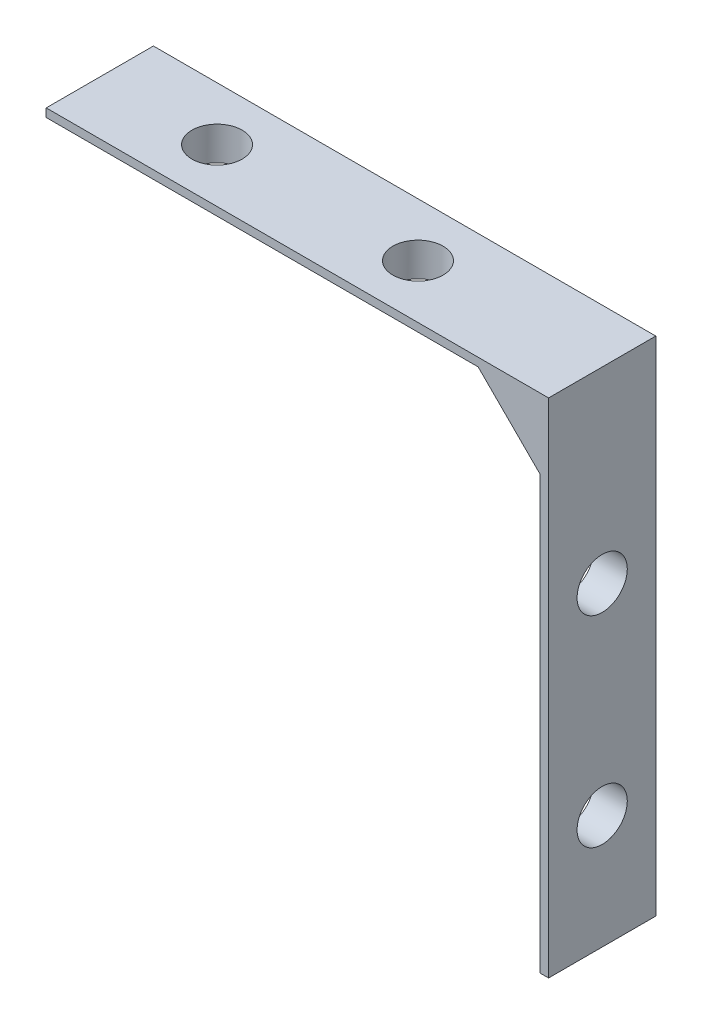
ISO-10303-21;
HEADER;
FILE_DESCRIPTION(('STEP AP214'),'2;1');
FILE_NAME('part.step','',(''),(''),'','','');
FILE_SCHEMA(('AUTOMOTIVE_DESIGN { 1 0 10303 214 1 1 1 1 }'));
ENDSEC;
DATA;
#1=APPLICATION_CONTEXT('core data for automotive mechanical design processes');
#2=APPLICATION_PROTOCOL_DEFINITION('international standard','automotive_design',2000,#1);
#3=PRODUCT_CONTEXT('',#1,'mechanical');
#4=PRODUCT('Part','Part','',(#3));
#5=PRODUCT_RELATED_PRODUCT_CATEGORY('part','',(#4));
#6=PRODUCT_DEFINITION_FORMATION('','',#4);
#7=PRODUCT_DEFINITION_CONTEXT('part definition',#1,'design');
#8=PRODUCT_DEFINITION('design','',#6,#7);
#9=PRODUCT_DEFINITION_SHAPE('','',#8);
#10=(LENGTH_UNIT() NAMED_UNIT(*) SI_UNIT(.MILLI.,.METRE.));
#11=(NAMED_UNIT(*) PLANE_ANGLE_UNIT() SI_UNIT($,.RADIAN.));
#12=(NAMED_UNIT(*) SI_UNIT($,.STERADIAN.) SOLID_ANGLE_UNIT());
#13=UNCERTAINTY_MEASURE_WITH_UNIT(LENGTH_MEASURE(1.E-05),#10,'distance_accuracy_value','');
#14=(GEOMETRIC_REPRESENTATION_CONTEXT(3) GLOBAL_UNCERTAINTY_ASSIGNED_CONTEXT((#13)) GLOBAL_UNIT_ASSIGNED_CONTEXT((#10,
#11,#12)) REPRESENTATION_CONTEXT('',''));
#15=CARTESIAN_POINT('',(0.,0.,0.));
#16=DIRECTION('',(0.,0.,1.));
#17=DIRECTION('',(1.,0.,0.));
#18=AXIS2_PLACEMENT_3D('',#15,#16,#17);
#19=CARTESIAN_POINT('',(-2.,-4.82842712474618,6.4));
#20=DIRECTION('',(1.,0.,0.));
#21=DIRECTION('',(0.,1.,0.));
#22=AXIS2_PLACEMENT_3D('',#19,#20,#21);
#23=PLANE('',#22);
#24=CARTESIAN_POINT('',(-2.,-11.1936831627406,3.2));
#25=DIRECTION('',(1.,0.,0.));
#26=DIRECTION('',(0.,1.,0.));
#27=AXIS2_PLACEMENT_3D('',#24,#25,#26);
#28=CIRCLE('',#27,1.5);
#29=CARTESIAN_POINT('',(-2.,-9.69368316274065,3.2));
#30=VERTEX_POINT('',#29);
#31=EDGE_CURVE('E331',#30,#30,#28,.F.);
#32=ORIENTED_EDGE('',*,*,#31,.F.);
#33=EDGE_LOOP('',(#32));
#34=FACE_BOUND('',#33,.T.);
#35=CARTESIAN_POINT('',(-2.,-23.1936831627406,3.2));
#36=DIRECTION('',(1.,0.,0.));
#37=DIRECTION('',(0.,1.,0.));
#38=AXIS2_PLACEMENT_3D('',#35,#36,#37);
#39=CIRCLE('',#38,1.5);
#40=CARTESIAN_POINT('',(-2.,-21.6936831627406,3.2));
#41=VERTEX_POINT('',#40);
#42=EDGE_CURVE('E326',#41,#41,#39,.F.);
#43=ORIENTED_EDGE('',*,*,#42,.F.);
#44=EDGE_LOOP('',(#43));
#45=FACE_BOUND('',#44,.T.);
#46=DIRECTION('',(0.,0.,-1.));
#47=VECTOR('',#46,1.);
#48=CARTESIAN_POINT('',(-2.,-30.,6.4));
#49=LINE('',#48,#47);
#50=CARTESIAN_POINT('',(-2.,-30.,4.9));
#51=VERTEX_POINT('',#50);
#52=CARTESIAN_POINT('',(-2.,-30.,1.5));
#53=VERTEX_POINT('',#52);
#54=EDGE_CURVE('E141',#51,#53,#49,.T.);
#55=ORIENTED_EDGE('',*,*,#54,.F.);
#56=DIRECTION('',(0.,1.,0.));
#57=VECTOR('',#56,1.);
#58=CARTESIAN_POINT('',(-2.,-4.82842712474618,4.9));
#59=LINE('',#58,#57);
#60=CARTESIAN_POINT('',(-2.,-4.82842712474618,4.9));
#61=VERTEX_POINT('',#60);
#62=EDGE_CURVE('E209',#51,#61,#59,.T.);
#63=ORIENTED_EDGE('',*,*,#62,.T.);
#64=DIRECTION('',(0.,0.,-1.));
#65=VECTOR('',#64,1.);
#66=CARTESIAN_POINT('',(-2.,-4.82842712474618,6.4));
#67=LINE('',#66,#65);
#68=CARTESIAN_POINT('',(-2.,-4.82842712474618,1.5));
#69=VERTEX_POINT('',#68);
#70=EDGE_CURVE('E155',#61,#69,#67,.T.);
#71=ORIENTED_EDGE('',*,*,#70,.T.);
#72=DIRECTION('',(0.,-1.,0.));
#73=VECTOR('',#72,1.);
#74=CARTESIAN_POINT('',(-2.,-30.,1.5));
#75=LINE('',#74,#73);
#76=EDGE_CURVE('E182',#69,#53,#75,.T.);
#77=ORIENTED_EDGE('',*,*,#76,.T.);
#78=EDGE_LOOP('',(#55,#63,#71,#77));
#79=FACE_BOUND('',#78,.T.);
#80=ADVANCED_FACE('F38',(#34,#45,#79),#23,.F.);
#81=CARTESIAN_POINT('',(0.,-30.,6.4));
#82=DIRECTION('',(0.,1.,0.));
#83=DIRECTION('',(-1.,0.,0.));
#84=AXIS2_PLACEMENT_3D('',#81,#82,#83);
#85=PLANE('',#84);
#86=DIRECTION('',(1.,0.,0.));
#87=VECTOR('',#86,1.);
#88=CARTESIAN_POINT('',(0.,-30.,6.4));
#89=LINE('',#88,#87);
#90=CARTESIAN_POINT('',(-0.499999999999996,-30.,6.4));
#91=VERTEX_POINT('',#90);
#92=CARTESIAN_POINT('',(0.,-30.,6.4));
#93=VERTEX_POINT('',#92);
#94=EDGE_CURVE('E123',#91,#93,#89,.T.);
#95=ORIENTED_EDGE('',*,*,#94,.F.);
#96=DIRECTION('',(0.707106781186547,0.,0.707106781186549));
#97=VECTOR('',#96,1.);
#98=CARTESIAN_POINT('',(-0.499999999999972,-30.,6.40000000000002));
#99=LINE('',#98,#97);
#100=EDGE_CURVE('E207',#91,#51,#99,.F.);
#101=ORIENTED_EDGE('',*,*,#100,.T.);
#102=ORIENTED_EDGE('',*,*,#54,.T.);
#103=DIRECTION('',(0.707106781186549,0.,-0.707106781186546));
#104=VECTOR('',#103,1.);
#105=CARTESIAN_POINT('',(-1.99999999999998,-30.,1.49999999999998));
#106=LINE('',#105,#104);
#107=CARTESIAN_POINT('',(-0.49999999999999,-30.,0.));
#108=VERTEX_POINT('',#107);
#109=EDGE_CURVE('E185',#53,#108,#106,.T.);
#110=ORIENTED_EDGE('',*,*,#109,.T.);
#111=DIRECTION('',(1.,0.,0.));
#112=VECTOR('',#111,1.);
#113=CARTESIAN_POINT('',(0.,-30.,0.));
#114=LINE('',#113,#112);
#115=CARTESIAN_POINT('',(0.,-30.,0.));
#116=VERTEX_POINT('',#115);
#117=EDGE_CURVE('E138',#108,#116,#114,.T.);
#118=ORIENTED_EDGE('',*,*,#117,.T.);
#119=DIRECTION('',(0.,0.,-1.));
#120=VECTOR('',#119,1.);
#121=CARTESIAN_POINT('',(0.,-30.,6.4));
#122=LINE('',#121,#120);
#123=EDGE_CURVE('E135',#93,#116,#122,.T.);
#124=ORIENTED_EDGE('',*,*,#123,.F.);
#125=EDGE_LOOP('',(#95,#101,#102,#110,#118,#124));
#126=FACE_BOUND('',#125,.T.);
#127=ADVANCED_FACE('F136',(#126),#85,.F.);
#128=CARTESIAN_POINT('',(0.,0.,6.4));
#129=DIRECTION('',(-1.,0.,0.));
#130=DIRECTION('',(0.,-1.,0.));
#131=AXIS2_PLACEMENT_3D('',#128,#129,#130);
#132=PLANE('',#131);
#133=CARTESIAN_POINT('',(0.,-11.1936831627406,3.2));
#134=DIRECTION('',(1.,0.,0.));
#135=DIRECTION('',(0.,0.,-1.));
#136=AXIS2_PLACEMENT_3D('',#133,#134,#135);
#137=CIRCLE('',#136,1.5);
#138=CARTESIAN_POINT('',(0.,-11.1936831627406,1.7));
#139=VERTEX_POINT('',#138);
#140=EDGE_CURVE('E322',#139,#139,#137,.T.);
#141=ORIENTED_EDGE('',*,*,#140,.F.);
#142=EDGE_LOOP('',(#141));
#143=FACE_BOUND('',#142,.T.);
#144=CARTESIAN_POINT('',(0.,-23.1936831627406,3.2));
#145=DIRECTION('',(1.,0.,0.));
#146=DIRECTION('',(0.,0.,-1.));
#147=AXIS2_PLACEMENT_3D('',#144,#145,#146);
#148=CIRCLE('',#147,1.5);
#149=CARTESIAN_POINT('',(0.,-23.1936831627406,1.7));
#150=VERTEX_POINT('',#149);
#151=EDGE_CURVE('E202',#150,#150,#148,.T.);
#152=ORIENTED_EDGE('',*,*,#151,.F.);
#153=EDGE_LOOP('',(#152));
#154=FACE_BOUND('',#153,.T.);
#155=DIRECTION('',(0.,1.,0.));
#156=VECTOR('',#155,1.);
#157=CARTESIAN_POINT('',(0.,0.,0.));
#158=LINE('',#157,#156);
#159=CARTESIAN_POINT('',(0.,0.,0.));
#160=VERTEX_POINT('',#159);
#161=EDGE_CURVE('E157',#116,#160,#158,.T.);
#162=ORIENTED_EDGE('',*,*,#161,.T.);
#163=DIRECTION('',(0.,0.,-1.));
#164=VECTOR('',#163,1.);
#165=CARTESIAN_POINT('',(0.,0.,6.4));
#166=LINE('',#165,#164);
#167=CARTESIAN_POINT('',(0.,0.,6.4));
#168=VERTEX_POINT('',#167);
#169=EDGE_CURVE('E142',#168,#160,#166,.T.);
#170=ORIENTED_EDGE('',*,*,#169,.F.);
#171=DIRECTION('',(0.,1.,0.));
#172=VECTOR('',#171,1.);
#173=CARTESIAN_POINT('',(0.,-2.,6.4));
#174=LINE('',#173,#172);
#175=EDGE_CURVE('E127',#93,#168,#174,.T.);
#176=ORIENTED_EDGE('',*,*,#175,.F.);
#177=ORIENTED_EDGE('',*,*,#123,.T.);
#178=EDGE_LOOP('',(#162,#170,#176,#177));
#179=FACE_BOUND('',#178,.T.);
#180=ADVANCED_FACE('F144',(#143,#154,#179),#132,.F.);
#181=CARTESIAN_POINT('',(0.,0.,6.4));
#182=DIRECTION('',(0.,-1.,0.));
#183=DIRECTION('',(1.,0.,0.));
#184=AXIS2_PLACEMENT_3D('',#181,#182,#183);
#185=PLANE('',#184);
#186=CARTESIAN_POINT('',(-23.,0.,3.2));
#187=DIRECTION('',(0.,1.,0.));
#188=DIRECTION('',(0.,0.,1.));
#189=AXIS2_PLACEMENT_3D('',#186,#187,#188);
#190=CIRCLE('',#189,1.5);
#191=CARTESIAN_POINT('',(-23.,0.,4.7));
#192=VERTEX_POINT('',#191);
#193=EDGE_CURVE('E334',#192,#192,#190,.T.);
#194=ORIENTED_EDGE('',*,*,#193,.F.);
#195=EDGE_LOOP('',(#194));
#196=FACE_BOUND('',#195,.T.);
#197=CARTESIAN_POINT('',(-11.,0.,3.2));
#198=DIRECTION('',(0.,1.,0.));
#199=DIRECTION('',(0.,0.,1.));
#200=AXIS2_PLACEMENT_3D('',#197,#198,#199);
#201=CIRCLE('',#200,1.5);
#202=CARTESIAN_POINT('',(-11.,0.,4.7));
#203=VERTEX_POINT('',#202);
#204=EDGE_CURVE('E340',#203,#203,#201,.T.);
#205=ORIENTED_EDGE('',*,*,#204,.F.);
#206=EDGE_LOOP('',(#205));
#207=FACE_BOUND('',#206,.T.);
#208=DIRECTION('',(-1.,0.,0.));
#209=VECTOR('',#208,1.);
#210=CARTESIAN_POINT('',(0.,0.,0.));
#211=LINE('',#210,#209);
#212=CARTESIAN_POINT('',(-30.,0.,0.));
#213=VERTEX_POINT('',#212);
#214=EDGE_CURVE('E160',#160,#213,#211,.T.);
#215=ORIENTED_EDGE('',*,*,#214,.T.);
#216=DIRECTION('',(0.,0.,-1.));
#217=VECTOR('',#216,1.);
#218=CARTESIAN_POINT('',(-30.,0.,6.4));
#219=LINE('',#218,#217);
#220=CARTESIAN_POINT('',(-30.,0.,6.4));
#221=VERTEX_POINT('',#220);
#222=EDGE_CURVE('E169',#221,#213,#219,.T.);
#223=ORIENTED_EDGE('',*,*,#222,.F.);
#224=DIRECTION('',(-1.,0.,0.));
#225=VECTOR('',#224,1.);
#226=CARTESIAN_POINT('',(0.,0.,6.4));
#227=LINE('',#226,#225);
#228=EDGE_CURVE('E147',#168,#221,#227,.T.);
#229=ORIENTED_EDGE('',*,*,#228,.F.);
#230=ORIENTED_EDGE('',*,*,#169,.T.);
#231=EDGE_LOOP('',(#215,#223,#229,#230));
#232=FACE_BOUND('',#231,.T.);
#233=ADVANCED_FACE('F230',(#196,#207,#232),#185,.F.);
#234=CARTESIAN_POINT('',(-30.,0.,6.4));
#235=DIRECTION('',(1.,0.,0.));
#236=DIRECTION('',(0.,0.,-1.));
#237=AXIS2_PLACEMENT_3D('',#234,#235,#236);
#238=PLANE('',#237);
#239=DIRECTION('',(0.,0.,-1.));
#240=VECTOR('',#239,1.);
#241=CARTESIAN_POINT('',(-30.,-2.,6.4));
#242=LINE('',#241,#240);
#243=CARTESIAN_POINT('',(-30.,-2.,4.9));
#244=VERTEX_POINT('',#243);
#245=CARTESIAN_POINT('',(-30.,-2.,1.5));
#246=VERTEX_POINT('',#245);
#247=EDGE_CURVE('E167',#244,#246,#242,.T.);
#248=ORIENTED_EDGE('',*,*,#247,.F.);
#249=DIRECTION('',(0.,-0.707106781186547,-0.707106781186548));
#250=VECTOR('',#249,1.);
#251=CARTESIAN_POINT('',(-30.,-0.5,6.4));
#252=LINE('',#251,#250);
#253=CARTESIAN_POINT('',(-30.,-0.500000000000002,6.4));
#254=VERTEX_POINT('',#253);
#255=EDGE_CURVE('E11',#244,#254,#252,.F.);
#256=ORIENTED_EDGE('',*,*,#255,.T.);
#257=DIRECTION('',(0.,-1.,0.));
#258=VECTOR('',#257,1.);
#259=CARTESIAN_POINT('',(-30.,0.,6.4));
#260=LINE('',#259,#258);
#261=EDGE_CURVE('E149',#221,#254,#260,.T.);
#262=ORIENTED_EDGE('',*,*,#261,.F.);
#263=ORIENTED_EDGE('',*,*,#222,.T.);
#264=DIRECTION('',(0.,-1.,0.));
#265=VECTOR('',#264,1.);
#266=CARTESIAN_POINT('',(-30.,0.,0.));
#267=LINE('',#266,#265);
#268=CARTESIAN_POINT('',(-30.,-0.499999999999999,0.));
#269=VERTEX_POINT('',#268);
#270=EDGE_CURVE('E132',#213,#269,#267,.T.);
#271=ORIENTED_EDGE('',*,*,#270,.T.);
#272=DIRECTION('',(0.,-0.707106781186548,0.707106781186547));
#273=VECTOR('',#272,1.);
#274=CARTESIAN_POINT('',(-30.,-2.,1.5));
#275=LINE('',#274,#273);
#276=EDGE_CURVE('E179',#269,#246,#275,.T.);
#277=ORIENTED_EDGE('',*,*,#276,.T.);
#278=EDGE_LOOP('',(#248,#256,#262,#263,#271,#277));
#279=FACE_BOUND('',#278,.T.);
#280=ADVANCED_FACE('F227',(#279),#238,.F.);
#281=CARTESIAN_POINT('',(-4.8284271247462,-2.,6.4));
#282=DIRECTION('',(0.,1.,0.));
#283=DIRECTION('',(-1.,0.,0.));
#284=AXIS2_PLACEMENT_3D('',#281,#282,#283);
#285=PLANE('',#284);
#286=CARTESIAN_POINT('',(-23.,-2.,3.2));
#287=DIRECTION('',(0.,1.,0.));
#288=DIRECTION('',(-1.,0.,0.));
#289=AXIS2_PLACEMENT_3D('',#286,#287,#288);
#290=CIRCLE('',#289,1.5);
#291=CARTESIAN_POINT('',(-24.5,-2.,3.2));
#292=VERTEX_POINT('',#291);
#293=EDGE_CURVE('E158',#292,#292,#290,.F.);
#294=ORIENTED_EDGE('',*,*,#293,.F.);
#295=EDGE_LOOP('',(#294));
#296=FACE_BOUND('',#295,.T.);
#297=CARTESIAN_POINT('',(-11.,-2.,3.2));
#298=DIRECTION('',(0.,1.,0.));
#299=DIRECTION('',(-1.,0.,0.));
#300=AXIS2_PLACEMENT_3D('',#297,#298,#299);
#301=CIRCLE('',#300,1.5);
#302=CARTESIAN_POINT('',(-12.5,-2.,3.2));
#303=VERTEX_POINT('',#302);
#304=EDGE_CURVE('E337',#303,#303,#301,.F.);
#305=ORIENTED_EDGE('',*,*,#304,.F.);
#306=EDGE_LOOP('',(#305));
#307=FACE_BOUND('',#306,.T.);
#308=DIRECTION('',(0.,0.,-1.));
#309=VECTOR('',#308,1.);
#310=CARTESIAN_POINT('',(-4.8284271247462,-2.,6.4));
#311=LINE('',#310,#309);
#312=CARTESIAN_POINT('',(-4.8284271247462,-2.,4.9));
#313=VERTEX_POINT('',#312);
#314=CARTESIAN_POINT('',(-4.8284271247462,-2.,1.5));
#315=VERTEX_POINT('',#314);
#316=EDGE_CURVE('E165',#313,#315,#311,.T.);
#317=ORIENTED_EDGE('',*,*,#316,.F.);
#318=DIRECTION('',(-1.,0.,0.));
#319=VECTOR('',#318,1.);
#320=CARTESIAN_POINT('',(-4.8284271247462,-2.,4.9));
#321=LINE('',#320,#319);
#322=EDGE_CURVE('E48',#313,#244,#321,.T.);
#323=ORIENTED_EDGE('',*,*,#322,.T.);
#324=ORIENTED_EDGE('',*,*,#247,.T.);
#325=DIRECTION('',(1.,0.,0.));
#326=VECTOR('',#325,1.);
#327=CARTESIAN_POINT('',(-4.8284271247462,-2.,1.5));
#328=LINE('',#327,#326);
#329=EDGE_CURVE('E174',#246,#315,#328,.T.);
#330=ORIENTED_EDGE('',*,*,#329,.T.);
#331=EDGE_LOOP('',(#317,#323,#324,#330));
#332=FACE_BOUND('',#331,.T.);
#333=ADVANCED_FACE('F242',(#296,#307,#332),#285,.F.);
#334=CARTESIAN_POINT('',(-4.8284271247462,-2.,6.4));
#335=DIRECTION('',(0.707106781186544,0.707106781186551,0.));
#336=DIRECTION('',(-0.707106781186551,0.707106781186544,0.));
#337=AXIS2_PLACEMENT_3D('',#334,#335,#336);
#338=PLANE('',#337);
#339=ORIENTED_EDGE('',*,*,#70,.F.);
#340=DIRECTION('',(-0.707106781186551,0.707106781186544,0.));
#341=VECTOR('',#340,1.);
#342=CARTESIAN_POINT('',(-4.8284271247462,-2.,4.9));
#343=LINE('',#342,#341);
#344=EDGE_CURVE('E63',#61,#313,#343,.T.);
#345=ORIENTED_EDGE('',*,*,#344,.T.);
#346=ORIENTED_EDGE('',*,*,#316,.T.);
#347=DIRECTION('',(0.707106781186551,-0.707106781186544,0.));
#348=VECTOR('',#347,1.);
#349=CARTESIAN_POINT('',(-2.,-4.82842712474618,1.5));
#350=LINE('',#349,#348);
#351=EDGE_CURVE('E192',#315,#69,#350,.T.);
#352=ORIENTED_EDGE('',*,*,#351,.T.);
#353=EDGE_LOOP('',(#339,#345,#346,#352));
#354=FACE_BOUND('',#353,.T.);
#355=ADVANCED_FACE('F247',(#354),#338,.F.);
#356=CARTESIAN_POINT('',(0.,0.,6.4));
#357=DIRECTION('',(0.,0.,-1.));
#358=DIRECTION('',(-1.,0.,0.));
#359=AXIS2_PLACEMENT_3D('',#356,#357,#358);
#360=PLANE('',#359);
#361=DIRECTION('',(0.707106781186551,-0.707106781186544,0.));
#362=VECTOR('',#361,1.);
#363=CARTESIAN_POINT('',(-2.35355339059326,-2.35355339059328,6.4));
#364=LINE('',#363,#362);
#365=CARTESIAN_POINT('',(-4.20710678118656,-0.499999999999999,6.4));
#366=VERTEX_POINT('',#365);
#367=CARTESIAN_POINT('',(-0.499999999999999,-4.20710678118653,6.4));
#368=VERTEX_POINT('',#367);
#369=EDGE_CURVE('E204',#366,#368,#364,.T.);
#370=ORIENTED_EDGE('',*,*,#369,.T.);
#371=DIRECTION('',(0.,-1.,0.));
#372=VECTOR('',#371,1.);
#373=CARTESIAN_POINT('',(-0.499999999999999,0.,6.4));
#374=LINE('',#373,#372);
#375=EDGE_CURVE('E130',#368,#91,#374,.T.);
#376=ORIENTED_EDGE('',*,*,#375,.T.);
#377=ORIENTED_EDGE('',*,*,#94,.T.);
#378=ORIENTED_EDGE('',*,*,#175,.T.);
#379=ORIENTED_EDGE('',*,*,#228,.T.);
#380=ORIENTED_EDGE('',*,*,#261,.T.);
#381=DIRECTION('',(1.,0.,0.));
#382=VECTOR('',#381,1.);
#383=CARTESIAN_POINT('',(0.,-0.499999999999999,6.4));
#384=LINE('',#383,#382);
#385=EDGE_CURVE('E198',#254,#366,#384,.T.);
#386=ORIENTED_EDGE('',*,*,#385,.T.);
#387=EDGE_LOOP('',(#370,#376,#377,#378,#379,#380,#386));
#388=FACE_BOUND('',#387,.T.);
#389=ADVANCED_FACE('F125',(#388),#360,.F.);
#390=CARTESIAN_POINT('',(0.,0.,0.));
#391=DIRECTION('',(0.,0.,-1.));
#392=DIRECTION('',(-1.,0.,0.));
#393=AXIS2_PLACEMENT_3D('',#390,#391,#392);
#394=PLANE('',#393);
#395=ORIENTED_EDGE('',*,*,#117,.F.);
#396=DIRECTION('',(0.,1.,0.));
#397=VECTOR('',#396,1.);
#398=CARTESIAN_POINT('',(-0.499999999999993,-4.82842712474618,0.));
#399=LINE('',#398,#397);
#400=CARTESIAN_POINT('',(-0.499999999999993,-4.20710678118652,0.));
#401=VERTEX_POINT('',#400);
#402=EDGE_CURVE('E190',#108,#401,#399,.T.);
#403=ORIENTED_EDGE('',*,*,#402,.T.);
#404=DIRECTION('',(-0.707106781186551,0.707106781186544,0.));
#405=VECTOR('',#404,1.);
#406=CARTESIAN_POINT('',(-5.2677669529664,0.560660171779836,0.));
#407=LINE('',#406,#405);
#408=CARTESIAN_POINT('',(-4.20710678118656,-0.499999999999996,0.));
#409=VERTEX_POINT('',#408);
#410=EDGE_CURVE('E187',#401,#409,#407,.T.);
#411=ORIENTED_EDGE('',*,*,#410,.T.);
#412=DIRECTION('',(-1.,0.,0.));
#413=VECTOR('',#412,1.);
#414=CARTESIAN_POINT('',(-30.,-0.499999999999999,0.));
#415=LINE('',#414,#413);
#416=EDGE_CURVE('E177',#409,#269,#415,.T.);
#417=ORIENTED_EDGE('',*,*,#416,.T.);
#418=ORIENTED_EDGE('',*,*,#270,.F.);
#419=ORIENTED_EDGE('',*,*,#214,.F.);
#420=ORIENTED_EDGE('',*,*,#161,.F.);
#421=EDGE_LOOP('',(#395,#403,#411,#417,#418,#419,#420));
#422=FACE_BOUND('',#421,.T.);
#423=ADVANCED_FACE('F235',(#422),#394,.T.);
#424=CARTESIAN_POINT('',(-11.,-6.24264068711929,3.2));
#425=DIRECTION('',(0.,1.,0.));
#426=DIRECTION('',(0.,0.,1.));
#427=AXIS2_PLACEMENT_3D('',#424,#425,#426);
#428=CYLINDRICAL_SURFACE('',#427,1.5);
#429=ORIENTED_EDGE('',*,*,#304,.T.);
#430=EDGE_LOOP('',(#429));
#431=FACE_BOUND('',#430,.T.);
#432=ORIENTED_EDGE('',*,*,#204,.T.);
#433=EDGE_LOOP('',(#432));
#434=FACE_BOUND('',#433,.T.);
#435=ADVANCED_FACE('F297',(#431,#434),#428,.F.);
#436=CARTESIAN_POINT('',(-23.,-6.24264068711929,3.2));
#437=DIRECTION('',(0.,1.,0.));
#438=DIRECTION('',(0.,0.,1.));
#439=AXIS2_PLACEMENT_3D('',#436,#437,#438);
#440=CYLINDRICAL_SURFACE('',#439,1.5);
#441=ORIENTED_EDGE('',*,*,#293,.T.);
#442=EDGE_LOOP('',(#441));
#443=FACE_BOUND('',#442,.T.);
#444=ORIENTED_EDGE('',*,*,#193,.T.);
#445=EDGE_LOOP('',(#444));
#446=FACE_BOUND('',#445,.T.);
#447=ADVANCED_FACE('F289',(#443,#446),#440,.F.);
#448=CARTESIAN_POINT('',(-6.24264068711929,-23.1936831627406,3.2));
#449=DIRECTION('',(1.,0.,0.));
#450=DIRECTION('',(0.,0.,-1.));
#451=AXIS2_PLACEMENT_3D('',#448,#449,#450);
#452=CYLINDRICAL_SURFACE('',#451,1.5);
#453=ORIENTED_EDGE('',*,*,#42,.T.);
#454=EDGE_LOOP('',(#453));
#455=FACE_BOUND('',#454,.T.);
#456=ORIENTED_EDGE('',*,*,#151,.T.);
#457=EDGE_LOOP('',(#456));
#458=FACE_BOUND('',#457,.T.);
#459=ADVANCED_FACE('F283',(#455,#458),#452,.F.);
#460=CARTESIAN_POINT('',(-6.24264068711929,-11.1936831627406,3.2));
#461=DIRECTION('',(1.,0.,0.));
#462=DIRECTION('',(0.,0.,-1.));
#463=AXIS2_PLACEMENT_3D('',#460,#461,#462);
#464=CYLINDRICAL_SURFACE('',#463,1.5);
#465=ORIENTED_EDGE('',*,*,#31,.T.);
#466=EDGE_LOOP('',(#465));
#467=FACE_BOUND('',#466,.T.);
#468=ORIENTED_EDGE('',*,*,#140,.T.);
#469=EDGE_LOOP('',(#468));
#470=FACE_BOUND('',#469,.T.);
#471=ADVANCED_FACE('F279',(#467,#470),#464,.F.);
#472=CARTESIAN_POINT('',(-4.8284271247462,-2.,1.5));
#473=DIRECTION('',(0.,-0.707106781186547,-0.707106781186548));
#474=DIRECTION('',(-1.,0.,0.));
#475=AXIS2_PLACEMENT_3D('',#472,#473,#474);
#476=PLANE('',#475);
#477=ORIENTED_EDGE('',*,*,#276,.F.);
#478=ORIENTED_EDGE('',*,*,#416,.F.);
#479=DIRECTION('',(-0.28108463771482,-0.678598344545848,0.678598344545846));
#480=VECTOR('',#479,1.);
#481=CARTESIAN_POINT('',(-4.8284271247462,-2.,1.5));
#482=LINE('',#481,#480);
#483=EDGE_CURVE('E195',#409,#315,#482,.T.);
#484=ORIENTED_EDGE('',*,*,#483,.T.);
#485=ORIENTED_EDGE('',*,*,#329,.F.);
#486=EDGE_LOOP('',(#477,#478,#484,#485));
#487=FACE_BOUND('',#486,.T.);
#488=ADVANCED_FACE('F239',(#487),#476,.T.);
#489=CARTESIAN_POINT('',(-4.8284271247462,-2.,1.5));
#490=DIRECTION('',(-0.499999999999996,-0.500000000000002,-0.707106781186549));
#491=DIRECTION('',(-0.707106781186551,0.707106781186544,0.));
#492=AXIS2_PLACEMENT_3D('',#489,#490,#491);
#493=PLANE('',#492);
#494=ORIENTED_EDGE('',*,*,#483,.F.);
#495=ORIENTED_EDGE('',*,*,#410,.F.);
#496=DIRECTION('',(-0.678598344545847,-0.281084637714823,0.678598344545845));
#497=VECTOR('',#496,1.);
#498=CARTESIAN_POINT('',(-2.,-4.82842712474618,1.5));
#499=LINE('',#498,#497);
#500=EDGE_CURVE('E199',#69,#401,#499,.F.);
#501=ORIENTED_EDGE('',*,*,#500,.F.);
#502=ORIENTED_EDGE('',*,*,#351,.F.);
#503=EDGE_LOOP('',(#494,#495,#501,#502));
#504=FACE_BOUND('',#503,.T.);
#505=ADVANCED_FACE('F245',(#504),#493,.T.);
#506=CARTESIAN_POINT('',(-2.,-4.82842712474618,1.5));
#507=DIRECTION('',(-0.707106781186546,0.,-0.707106781186549));
#508=DIRECTION('',(0.,1.,0.));
#509=AXIS2_PLACEMENT_3D('',#506,#507,#508);
#510=PLANE('',#509);
#511=ORIENTED_EDGE('',*,*,#500,.T.);
#512=ORIENTED_EDGE('',*,*,#402,.F.);
#513=ORIENTED_EDGE('',*,*,#109,.F.);
#514=ORIENTED_EDGE('',*,*,#76,.F.);
#515=EDGE_LOOP('',(#511,#512,#513,#514));
#516=FACE_BOUND('',#515,.T.);
#517=ADVANCED_FACE('F254',(#516),#510,.T.);
#518=CARTESIAN_POINT('',(0.,-0.499999999999999,6.4));
#519=DIRECTION('',(0.,0.707106781186548,-0.707106781186547));
#520=DIRECTION('',(1.,0.,0.));
#521=AXIS2_PLACEMENT_3D('',#518,#519,#520);
#522=PLANE('',#521);
#523=ORIENTED_EDGE('',*,*,#255,.F.);
#524=ORIENTED_EDGE('',*,*,#322,.F.);
#525=DIRECTION('',(0.281084637714818,0.678598344545847,0.678598344545848));
#526=VECTOR('',#525,1.);
#527=CARTESIAN_POINT('',(-4.41421356237311,-1.,5.9));
#528=LINE('',#527,#526);
#529=EDGE_CURVE('E43',#366,#313,#528,.F.);
#530=ORIENTED_EDGE('',*,*,#529,.F.);
#531=ORIENTED_EDGE('',*,*,#385,.F.);
#532=EDGE_LOOP('',(#523,#524,#530,#531));
#533=FACE_BOUND('',#532,.T.);
#534=ADVANCED_FACE('F41',(#533),#522,.F.);
#535=CARTESIAN_POINT('',(-2.35355339059326,-2.35355339059328,6.4));
#536=DIRECTION('',(0.499999999999998,0.500000000000003,-0.707106781186547));
#537=DIRECTION('',(0.707106781186551,-0.707106781186544,0.));
#538=AXIS2_PLACEMENT_3D('',#535,#536,#537);
#539=PLANE('',#538);
#540=ORIENTED_EDGE('',*,*,#529,.T.);
#541=ORIENTED_EDGE('',*,*,#344,.F.);
#542=DIRECTION('',(0.678598344545846,0.281084637714822,0.678598344545848));
#543=VECTOR('',#542,1.);
#544=CARTESIAN_POINT('',(0.302478566101821,-3.87470927559344,7.20247856610182));
#545=LINE('',#544,#543);
#546=EDGE_CURVE('E212',#368,#61,#545,.F.);
#547=ORIENTED_EDGE('',*,*,#546,.F.);
#548=ORIENTED_EDGE('',*,*,#369,.F.);
#549=EDGE_LOOP('',(#540,#541,#547,#548));
#550=FACE_BOUND('',#549,.T.);
#551=ADVANCED_FACE('F221',(#550),#539,.F.);
#552=CARTESIAN_POINT('',(-0.499999999999999,0.,6.4));
#553=DIRECTION('',(0.707106781186549,0.,-0.707106781186547));
#554=DIRECTION('',(0.,-1.,0.));
#555=AXIS2_PLACEMENT_3D('',#552,#553,#554);
#556=PLANE('',#555);
#557=ORIENTED_EDGE('',*,*,#546,.T.);
#558=ORIENTED_EDGE('',*,*,#62,.F.);
#559=ORIENTED_EDGE('',*,*,#100,.F.);
#560=ORIENTED_EDGE('',*,*,#375,.F.);
#561=EDGE_LOOP('',(#557,#558,#559,#560));
#562=FACE_BOUND('',#561,.T.);
#563=ADVANCED_FACE('F250',(#562),#556,.F.);
#564=CLOSED_SHELL('',(#80,#127,#180,#233,#280,#333,#355,#389,#423,#435,#447,#459,#471,#488,#505,
#517,#534,#551,#563));
#565=MANIFOLD_SOLID_BREP('B2',#564);
#566=ADVANCED_BREP_SHAPE_REPRESENTATION('',(#18,#565),#14);
#567=SHAPE_DEFINITION_REPRESENTATION(#9,#566);
ENDSEC;
END-ISO-10303-21;
